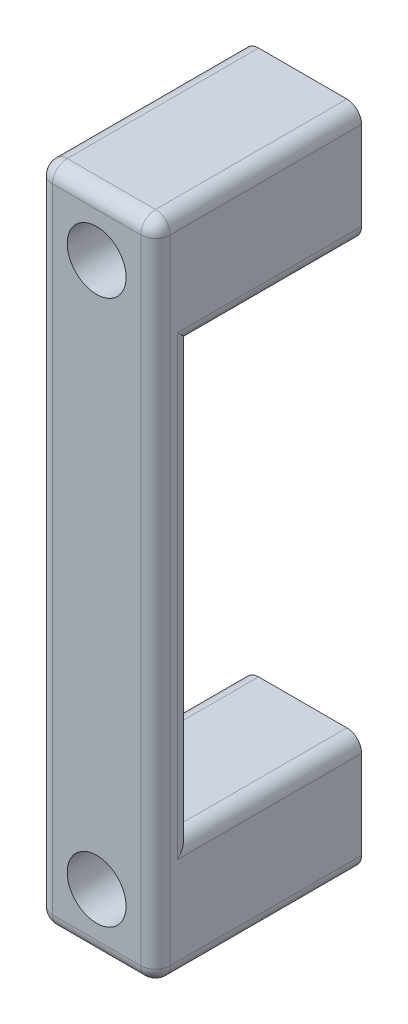
ISO-10303-21;
HEADER;
FILE_DESCRIPTION(('STEP AP214'),'2;1');
FILE_NAME('part.step','',(''),(''),'','','');
FILE_SCHEMA(('AUTOMOTIVE_DESIGN { 1 0 10303 214 1 1 1 1 }'));
ENDSEC;
DATA;
#1=APPLICATION_CONTEXT('core data for automotive mechanical design processes');
#2=APPLICATION_PROTOCOL_DEFINITION('international standard','automotive_design',2000,#1);
#3=PRODUCT_CONTEXT('',#1,'mechanical');
#4=PRODUCT('Part','Part','',(#3));
#5=PRODUCT_RELATED_PRODUCT_CATEGORY('part','',(#4));
#6=PRODUCT_DEFINITION_FORMATION('','',#4);
#7=PRODUCT_DEFINITION_CONTEXT('part definition',#1,'design');
#8=PRODUCT_DEFINITION('design','',#6,#7);
#9=PRODUCT_DEFINITION_SHAPE('','',#8);
#10=(LENGTH_UNIT() NAMED_UNIT(*) SI_UNIT(.MILLI.,.METRE.));
#11=(NAMED_UNIT(*) PLANE_ANGLE_UNIT() SI_UNIT($,.RADIAN.));
#12=(NAMED_UNIT(*) SI_UNIT($,.STERADIAN.) SOLID_ANGLE_UNIT());
#13=UNCERTAINTY_MEASURE_WITH_UNIT(LENGTH_MEASURE(1.E-05),#10,'distance_accuracy_value','');
#14=(GEOMETRIC_REPRESENTATION_CONTEXT(3) GLOBAL_UNCERTAINTY_ASSIGNED_CONTEXT((#13)) GLOBAL_UNIT_ASSIGNED_CONTEXT((#10,
#11,#12)) REPRESENTATION_CONTEXT('',''));
#15=CARTESIAN_POINT('',(0.,0.,0.));
#16=DIRECTION('',(0.,0.,1.));
#17=DIRECTION('',(1.,0.,0.));
#18=AXIS2_PLACEMENT_3D('',#15,#16,#17);
#19=CARTESIAN_POINT('',(0.,0.,0.));
#20=DIRECTION('',(0.,0.,-1.));
#21=DIRECTION('',(-1.,0.,0.));
#22=AXIS2_PLACEMENT_3D('',#19,#20,#21);
#23=PLANE('',#22);
#24=DIRECTION('',(1.,0.,0.));
#25=VECTOR('',#24,1.);
#26=CARTESIAN_POINT('',(-62.393909959226,16.,0.));
#27=LINE('',#26,#25);
#28=CARTESIAN_POINT('',(2.,16.,0.));
#29=VERTEX_POINT('',#28);
#30=CARTESIAN_POINT('',(14.,16.,0.));
#31=VERTEX_POINT('',#30);
#32=EDGE_CURVE('E397',#29,#31,#27,.T.);
#33=ORIENTED_EDGE('',*,*,#32,.T.);
#34=CARTESIAN_POINT('',(14.,14.,0.));
#35=DIRECTION('',(0.,0.,-1.));
#36=DIRECTION('',(-1.,0.,0.));
#37=AXIS2_PLACEMENT_3D('',#34,#35,#36);
#38=CIRCLE('',#37,2.);
#39=CARTESIAN_POINT('',(16.,14.,0.));
#40=VERTEX_POINT('',#39);
#41=EDGE_CURVE('E272',#31,#40,#38,.T.);
#42=ORIENTED_EDGE('',*,*,#41,.T.);
#43=DIRECTION('',(0.,1.,0.));
#44=VECTOR('',#43,1.);
#45=CARTESIAN_POINT('',(16.,0.,0.));
#46=LINE('',#45,#44);
#47=CARTESIAN_POINT('',(16.,2.,0.));
#48=VERTEX_POINT('',#47);
#49=EDGE_CURVE('E198',#48,#40,#46,.T.);
#50=ORIENTED_EDGE('',*,*,#49,.F.);
#51=CARTESIAN_POINT('',(14.,2.,0.));
#52=DIRECTION('',(0.,0.,-1.));
#53=DIRECTION('',(-1.,0.,0.));
#54=AXIS2_PLACEMENT_3D('',#51,#52,#53);
#55=CIRCLE('',#54,2.);
#56=CARTESIAN_POINT('',(14.,0.,0.));
#57=VERTEX_POINT('',#56);
#58=EDGE_CURVE('E269',#48,#57,#55,.T.);
#59=ORIENTED_EDGE('',*,*,#58,.T.);
#60=DIRECTION('',(1.,0.,0.));
#61=VECTOR('',#60,1.);
#62=CARTESIAN_POINT('',(0.,0.,0.));
#63=LINE('',#62,#61);
#64=CARTESIAN_POINT('',(2.,0.,0.));
#65=VERTEX_POINT('',#64);
#66=EDGE_CURVE('E405',#65,#57,#63,.T.);
#67=ORIENTED_EDGE('',*,*,#66,.F.);
#68=CARTESIAN_POINT('',(2.,2.,0.));
#69=DIRECTION('',(0.,0.,-1.));
#70=DIRECTION('',(-1.,0.,0.));
#71=AXIS2_PLACEMENT_3D('',#68,#69,#70);
#72=CIRCLE('',#71,2.);
#73=CARTESIAN_POINT('',(0.,2.,0.));
#74=VERTEX_POINT('',#73);
#75=EDGE_CURVE('E266',#65,#74,#72,.T.);
#76=ORIENTED_EDGE('',*,*,#75,.T.);
#77=DIRECTION('',(0.,-1.,0.));
#78=VECTOR('',#77,1.);
#79=CARTESIAN_POINT('',(0.,0.,0.));
#80=LINE('',#79,#78);
#81=CARTESIAN_POINT('',(0.,14.,0.));
#82=VERTEX_POINT('',#81);
#83=EDGE_CURVE('E401',#82,#74,#80,.T.);
#84=ORIENTED_EDGE('',*,*,#83,.F.);
#85=CARTESIAN_POINT('',(2.,14.,0.));
#86=DIRECTION('',(0.,0.,-1.));
#87=DIRECTION('',(-1.,0.,0.));
#88=AXIS2_PLACEMENT_3D('',#85,#86,#87);
#89=CIRCLE('',#88,2.);
#90=EDGE_CURVE('E263',#82,#29,#89,.T.);
#91=ORIENTED_EDGE('',*,*,#90,.T.);
#92=EDGE_LOOP('',(#33,#42,#50,#59,#67,#76,#84,#91));
#93=FACE_BOUND('',#92,.T.);
#94=CARTESIAN_POINT('',(8.00000000000001,7.99999999999999,0.));
#95=DIRECTION('',(0.,0.,1.));
#96=DIRECTION('',(1.,0.,0.));
#97=AXIS2_PLACEMENT_3D('',#94,#95,#96);
#98=CIRCLE('',#97,2.2);
#99=CARTESIAN_POINT('',(10.2,7.99999999999999,0.));
#100=VERTEX_POINT('',#99);
#101=EDGE_CURVE('E392',#100,#100,#98,.T.);
#102=ORIENTED_EDGE('',*,*,#101,.T.);
#103=EDGE_LOOP('',(#102));
#104=FACE_BOUND('',#103,.T.);
#105=ADVANCED_FACE('F41',(#93,#104),#23,.T.);
#106=CARTESIAN_POINT('',(0.,0.,28.));
#107=DIRECTION('',(0.,0.,-1.));
#108=DIRECTION('',(-1.,0.,0.));
#109=AXIS2_PLACEMENT_3D('',#106,#107,#108);
#110=PLANE('',#109);
#111=DIRECTION('',(1.,0.,0.));
#112=VECTOR('',#111,1.);
#113=CARTESIAN_POINT('',(0.,2.,28.));
#114=LINE('',#113,#112);
#115=CARTESIAN_POINT('',(2.,2.,28.));
#116=VERTEX_POINT('',#115);
#117=CARTESIAN_POINT('',(14.,2.,28.));
#118=VERTEX_POINT('',#117);
#119=EDGE_CURVE('E290',#116,#118,#114,.T.);
#120=ORIENTED_EDGE('',*,*,#119,.T.);
#121=DIRECTION('',(0.,1.,0.));
#122=VECTOR('',#121,1.);
#123=CARTESIAN_POINT('',(14.,0.,28.));
#124=LINE('',#123,#122);
#125=CARTESIAN_POINT('',(14.,88.,28.));
#126=VERTEX_POINT('',#125);
#127=EDGE_CURVE('E293',#118,#126,#124,.T.);
#128=ORIENTED_EDGE('',*,*,#127,.T.);
#129=DIRECTION('',(-1.,0.,0.));
#130=VECTOR('',#129,1.);
#131=CARTESIAN_POINT('',(0.,88.,28.));
#132=LINE('',#131,#130);
#133=CARTESIAN_POINT('',(2.,88.,28.));
#134=VERTEX_POINT('',#133);
#135=EDGE_CURVE('E287',#126,#134,#132,.T.);
#136=ORIENTED_EDGE('',*,*,#135,.T.);
#137=DIRECTION('',(0.,-1.,0.));
#138=VECTOR('',#137,1.);
#139=CARTESIAN_POINT('',(2.,0.,28.));
#140=LINE('',#139,#138);
#141=EDGE_CURVE('E284',#134,#116,#140,.T.);
#142=ORIENTED_EDGE('',*,*,#141,.T.);
#143=EDGE_LOOP('',(#120,#128,#136,#142));
#144=FACE_BOUND('',#143,.T.);
#145=CARTESIAN_POINT('',(8.,82.,28.));
#146=DIRECTION('',(0.,0.,1.));
#147=DIRECTION('',(1.,0.,0.));
#148=AXIS2_PLACEMENT_3D('',#145,#146,#147);
#149=CIRCLE('',#148,4.);
#150=CARTESIAN_POINT('',(12.,82.,28.));
#151=VERTEX_POINT('',#150);
#152=EDGE_CURVE('E487',#151,#151,#149,.T.);
#153=ORIENTED_EDGE('',*,*,#152,.F.);
#154=EDGE_LOOP('',(#153));
#155=FACE_BOUND('',#154,.T.);
#156=CARTESIAN_POINT('',(8.00000000000001,7.99999999999999,28.));
#157=DIRECTION('',(0.,0.,1.));
#158=DIRECTION('',(1.,0.,0.));
#159=AXIS2_PLACEMENT_3D('',#156,#157,#158);
#160=CIRCLE('',#159,4.);
#161=CARTESIAN_POINT('',(12.,7.99999999999999,28.));
#162=VERTEX_POINT('',#161);
#163=EDGE_CURVE('E357',#162,#162,#160,.T.);
#164=ORIENTED_EDGE('',*,*,#163,.F.);
#165=EDGE_LOOP('',(#164));
#166=FACE_BOUND('',#165,.T.);
#167=ADVANCED_FACE('F501',(#144,#155,#166),#110,.F.);
#168=DIRECTION('',(-1.,0.,0.));
#169=VECTOR('',#168,1.);
#170=CARTESIAN_POINT('',(0.,90.,0.));
#171=LINE('',#170,#169);
#172=CARTESIAN_POINT('',(14.,90.,0.));
#173=VERTEX_POINT('',#172);
#174=CARTESIAN_POINT('',(2.,90.,0.));
#175=VERTEX_POINT('',#174);
#176=EDGE_CURVE('E184',#173,#175,#171,.T.);
#177=ORIENTED_EDGE('',*,*,#176,.F.);
#178=CARTESIAN_POINT('',(14.,88.,0.));
#179=DIRECTION('',(0.,0.,-1.));
#180=DIRECTION('',(-1.,0.,0.));
#181=AXIS2_PLACEMENT_3D('',#178,#179,#180);
#182=CIRCLE('',#181,2.);
#183=CARTESIAN_POINT('',(16.,88.,0.));
#184=VERTEX_POINT('',#183);
#185=EDGE_CURVE('E167',#173,#184,#182,.T.);
#186=ORIENTED_EDGE('',*,*,#185,.T.);
#187=CARTESIAN_POINT('',(16.,76.,0.));
#188=VERTEX_POINT('',#187);
#189=EDGE_CURVE('E204',#188,#184,#46,.T.);
#190=ORIENTED_EDGE('',*,*,#189,.F.);
#191=CARTESIAN_POINT('',(14.,76.,0.));
#192=DIRECTION('',(0.,0.,-1.));
#193=DIRECTION('',(-1.,0.,0.));
#194=AXIS2_PLACEMENT_3D('',#191,#192,#193);
#195=CIRCLE('',#194,2.);
#196=CARTESIAN_POINT('',(14.,74.,0.));
#197=VERTEX_POINT('',#196);
#198=EDGE_CURVE('E179',#188,#197,#195,.T.);
#199=ORIENTED_EDGE('',*,*,#198,.T.);
#200=DIRECTION('',(1.,0.,0.));
#201=VECTOR('',#200,1.);
#202=CARTESIAN_POINT('',(-62.393909959226,74.,0.));
#203=LINE('',#202,#201);
#204=CARTESIAN_POINT('',(2.,74.,0.));
#205=VERTEX_POINT('',#204);
#206=EDGE_CURVE('E216',#205,#197,#203,.T.);
#207=ORIENTED_EDGE('',*,*,#206,.F.);
#208=CARTESIAN_POINT('',(2.,76.,0.));
#209=DIRECTION('',(0.,0.,-1.));
#210=DIRECTION('',(-1.,0.,0.));
#211=AXIS2_PLACEMENT_3D('',#208,#209,#210);
#212=CIRCLE('',#211,2.);
#213=CARTESIAN_POINT('',(0.,76.,0.));
#214=VERTEX_POINT('',#213);
#215=EDGE_CURVE('E222',#205,#214,#212,.T.);
#216=ORIENTED_EDGE('',*,*,#215,.T.);
#217=CARTESIAN_POINT('',(0.,88.,0.));
#218=VERTEX_POINT('',#217);
#219=EDGE_CURVE('E404',#218,#214,#80,.T.);
#220=ORIENTED_EDGE('',*,*,#219,.F.);
#221=CARTESIAN_POINT('',(2.,88.,0.));
#222=DIRECTION('',(0.,0.,-1.));
#223=DIRECTION('',(-1.,0.,0.));
#224=AXIS2_PLACEMENT_3D('',#221,#222,#223);
#225=CIRCLE('',#224,2.);
#226=EDGE_CURVE('E190',#218,#175,#225,.T.);
#227=ORIENTED_EDGE('',*,*,#226,.T.);
#228=EDGE_LOOP('',(#177,#186,#190,#199,#207,#216,#220,#227));
#229=FACE_BOUND('',#228,.T.);
#230=CARTESIAN_POINT('',(8.,82.,0.));
#231=DIRECTION('',(0.,0.,1.));
#232=DIRECTION('',(1.,0.,0.));
#233=AXIS2_PLACEMENT_3D('',#230,#231,#232);
#234=CIRCLE('',#233,2.19999999999999);
#235=CARTESIAN_POINT('',(10.2,82.,0.));
#236=VERTEX_POINT('',#235);
#237=EDGE_CURVE('E396',#236,#236,#234,.T.);
#238=ORIENTED_EDGE('',*,*,#237,.T.);
#239=EDGE_LOOP('',(#238));
#240=FACE_BOUND('',#239,.T.);
#241=ADVANCED_FACE('F192',(#229,#240),#23,.T.);
#242=CARTESIAN_POINT('',(0.,0.,28.));
#243=DIRECTION('',(1.,0.,0.));
#244=DIRECTION('',(0.,0.,-1.));
#245=AXIS2_PLACEMENT_3D('',#242,#243,#244);
#246=PLANE('',#245);
#247=DIRECTION('',(0.,1.,0.));
#248=VECTOR('',#247,1.);
#249=CARTESIAN_POINT('',(0.,0.,25.));
#250=LINE('',#249,#248);
#251=CARTESIAN_POINT('',(0.,76.,25.));
#252=VERTEX_POINT('',#251);
#253=CARTESIAN_POINT('',(0.,14.,25.));
#254=VERTEX_POINT('',#253);
#255=EDGE_CURVE('E51',#252,#254,#250,.F.);
#256=ORIENTED_EDGE('',*,*,#255,.T.);
#257=DIRECTION('',(0.,0.,1.));
#258=VECTOR('',#257,1.);
#259=CARTESIAN_POINT('',(0.,14.,28.));
#260=LINE('',#259,#258);
#261=EDGE_CURVE('E12',#254,#82,#260,.F.);
#262=ORIENTED_EDGE('',*,*,#261,.T.);
#263=ORIENTED_EDGE('',*,*,#83,.T.);
#264=DIRECTION('',(0.,0.,-1.));
#265=VECTOR('',#264,1.);
#266=CARTESIAN_POINT('',(0.,2.,28.));
#267=LINE('',#266,#265);
#268=CARTESIAN_POINT('',(0.,2.,26.));
#269=VERTEX_POINT('',#268);
#270=EDGE_CURVE('E303',#74,#269,#267,.F.);
#271=ORIENTED_EDGE('',*,*,#270,.T.);
#272=DIRECTION('',(0.,-1.,0.));
#273=VECTOR('',#272,1.);
#274=CARTESIAN_POINT('',(0.,0.,26.));
#275=LINE('',#274,#273);
#276=CARTESIAN_POINT('',(0.,88.,26.));
#277=VERTEX_POINT('',#276);
#278=EDGE_CURVE('E297',#269,#277,#275,.F.);
#279=ORIENTED_EDGE('',*,*,#278,.T.);
#280=DIRECTION('',(0.,0.,-1.));
#281=VECTOR('',#280,1.);
#282=CARTESIAN_POINT('',(0.,88.,28.));
#283=LINE('',#282,#281);
#284=EDGE_CURVE('E300',#277,#218,#283,.T.);
#285=ORIENTED_EDGE('',*,*,#284,.T.);
#286=ORIENTED_EDGE('',*,*,#219,.T.);
#287=DIRECTION('',(0.,0.,-1.));
#288=VECTOR('',#287,1.);
#289=CARTESIAN_POINT('',(0.,76.,28.));
#290=LINE('',#289,#288);
#291=EDGE_CURVE('E62',#214,#252,#290,.F.);
#292=ORIENTED_EDGE('',*,*,#291,.T.);
#293=EDGE_LOOP('',(#256,#262,#263,#271,#279,#285,#286,#292));
#294=FACE_BOUND('',#293,.T.);
#295=ADVANCED_FACE('F413',(#294),#246,.F.);
#296=CARTESIAN_POINT('',(0.,0.,28.));
#297=DIRECTION('',(0.,1.,0.));
#298=DIRECTION('',(0.,0.,1.));
#299=AXIS2_PLACEMENT_3D('',#296,#297,#298);
#300=PLANE('',#299);
#301=ORIENTED_EDGE('',*,*,#66,.T.);
#302=DIRECTION('',(0.,0.,-1.));
#303=VECTOR('',#302,1.);
#304=CARTESIAN_POINT('',(14.,0.,28.));
#305=LINE('',#304,#303);
#306=CARTESIAN_POINT('',(14.,0.,26.));
#307=VERTEX_POINT('',#306);
#308=EDGE_CURVE('E281',#57,#307,#305,.F.);
#309=ORIENTED_EDGE('',*,*,#308,.T.);
#310=DIRECTION('',(1.,0.,0.));
#311=VECTOR('',#310,1.);
#312=CARTESIAN_POINT('',(0.,0.,26.));
#313=LINE('',#312,#311);
#314=CARTESIAN_POINT('',(2.,0.,26.));
#315=VERTEX_POINT('',#314);
#316=EDGE_CURVE('E278',#307,#315,#313,.F.);
#317=ORIENTED_EDGE('',*,*,#316,.T.);
#318=DIRECTION('',(0.,0.,-1.));
#319=VECTOR('',#318,1.);
#320=CARTESIAN_POINT('',(2.,0.,28.));
#321=LINE('',#320,#319);
#322=EDGE_CURVE('E275',#315,#65,#321,.T.);
#323=ORIENTED_EDGE('',*,*,#322,.T.);
#324=EDGE_LOOP('',(#301,#309,#317,#323));
#325=FACE_BOUND('',#324,.T.);
#326=ADVANCED_FACE('F451',(#325),#300,.F.);
#327=CARTESIAN_POINT('',(16.,0.,28.));
#328=DIRECTION('',(-1.,0.,0.));
#329=DIRECTION('',(0.,0.,1.));
#330=AXIS2_PLACEMENT_3D('',#327,#328,#329);
#331=PLANE('',#330);
#332=DIRECTION('',(0.,-1.,0.));
#333=VECTOR('',#332,1.);
#334=CARTESIAN_POINT('',(16.,0.,25.));
#335=LINE('',#334,#333);
#336=CARTESIAN_POINT('',(16.,14.,25.));
#337=VERTEX_POINT('',#336);
#338=CARTESIAN_POINT('',(16.,76.,25.));
#339=VERTEX_POINT('',#338);
#340=EDGE_CURVE('E237',#337,#339,#335,.F.);
#341=ORIENTED_EDGE('',*,*,#340,.T.);
#342=DIRECTION('',(0.,0.,1.));
#343=VECTOR('',#342,1.);
#344=CARTESIAN_POINT('',(16.,76.,28.));
#345=LINE('',#344,#343);
#346=EDGE_CURVE('E240',#339,#188,#345,.F.);
#347=ORIENTED_EDGE('',*,*,#346,.T.);
#348=ORIENTED_EDGE('',*,*,#189,.T.);
#349=DIRECTION('',(0.,0.,-1.));
#350=VECTOR('',#349,1.);
#351=CARTESIAN_POINT('',(16.,88.,28.));
#352=LINE('',#351,#350);
#353=CARTESIAN_POINT('',(16.,88.,26.));
#354=VERTEX_POINT('',#353);
#355=EDGE_CURVE('E172',#184,#354,#352,.F.);
#356=ORIENTED_EDGE('',*,*,#355,.T.);
#357=DIRECTION('',(0.,1.,0.));
#358=VECTOR('',#357,1.);
#359=CARTESIAN_POINT('',(16.,0.,26.));
#360=LINE('',#359,#358);
#361=CARTESIAN_POINT('',(16.,2.,26.));
#362=VERTEX_POINT('',#361);
#363=EDGE_CURVE('E178',#354,#362,#360,.F.);
#364=ORIENTED_EDGE('',*,*,#363,.T.);
#365=DIRECTION('',(0.,0.,-1.));
#366=VECTOR('',#365,1.);
#367=CARTESIAN_POINT('',(16.,2.,28.));
#368=LINE('',#367,#366);
#369=EDGE_CURVE('E229',#362,#48,#368,.T.);
#370=ORIENTED_EDGE('',*,*,#369,.T.);
#371=ORIENTED_EDGE('',*,*,#49,.T.);
#372=DIRECTION('',(0.,0.,-1.));
#373=VECTOR('',#372,1.);
#374=CARTESIAN_POINT('',(16.,14.,28.));
#375=LINE('',#374,#373);
#376=EDGE_CURVE('E234',#40,#337,#375,.F.);
#377=ORIENTED_EDGE('',*,*,#376,.T.);
#378=EDGE_LOOP('',(#341,#347,#348,#356,#364,#370,#371,#377));
#379=FACE_BOUND('',#378,.T.);
#380=ADVANCED_FACE('F436',(#379),#331,.F.);
#381=CARTESIAN_POINT('',(0.,90.,28.));
#382=DIRECTION('',(0.,-1.,0.));
#383=DIRECTION('',(0.,0.,-1.));
#384=AXIS2_PLACEMENT_3D('',#381,#382,#383);
#385=PLANE('',#384);
#386=DIRECTION('',(-1.,0.,0.));
#387=VECTOR('',#386,1.);
#388=CARTESIAN_POINT('',(0.,90.,26.));
#389=LINE('',#388,#387);
#390=CARTESIAN_POINT('',(2.,90.,26.));
#391=VERTEX_POINT('',#390);
#392=CARTESIAN_POINT('',(14.,90.,26.));
#393=VERTEX_POINT('',#392);
#394=EDGE_CURVE('E187',#391,#393,#389,.F.);
#395=ORIENTED_EDGE('',*,*,#394,.T.);
#396=DIRECTION('',(0.,0.,-1.));
#397=VECTOR('',#396,1.);
#398=CARTESIAN_POINT('',(14.,90.,28.));
#399=LINE('',#398,#397);
#400=EDGE_CURVE('E171',#393,#173,#399,.T.);
#401=ORIENTED_EDGE('',*,*,#400,.T.);
#402=ORIENTED_EDGE('',*,*,#176,.T.);
#403=DIRECTION('',(0.,0.,-1.));
#404=VECTOR('',#403,1.);
#405=CARTESIAN_POINT('',(2.,90.,28.));
#406=LINE('',#405,#404);
#407=EDGE_CURVE('E197',#175,#391,#406,.F.);
#408=ORIENTED_EDGE('',*,*,#407,.T.);
#409=EDGE_LOOP('',(#395,#401,#402,#408));
#410=FACE_BOUND('',#409,.T.);
#411=ADVANCED_FACE('F183',(#410),#385,.F.);
#412=CARTESIAN_POINT('',(8.,82.,28.));
#413=DIRECTION('',(0.,0.,-1.));
#414=DIRECTION('',(-1.,0.,0.));
#415=AXIS2_PLACEMENT_3D('',#412,#413,#414);
#416=CYLINDRICAL_SURFACE('',#415,2.19999999999999);
#417=CARTESIAN_POINT('',(8.,82.,6.));
#418=DIRECTION('',(0.,0.,-1.));
#419=DIRECTION('',(-1.,0.,0.));
#420=AXIS2_PLACEMENT_3D('',#417,#418,#419);
#421=CIRCLE('',#420,2.19999999999999);
#422=CARTESIAN_POINT('',(5.80000000000001,82.,6.));
#423=VERTEX_POINT('',#422);
#424=EDGE_CURVE('E212',#423,#423,#421,.T.);
#425=ORIENTED_EDGE('',*,*,#424,.F.);
#426=EDGE_LOOP('',(#425));
#427=FACE_BOUND('',#426,.T.);
#428=ORIENTED_EDGE('',*,*,#237,.F.);
#429=EDGE_LOOP('',(#428));
#430=FACE_BOUND('',#429,.T.);
#431=ADVANCED_FACE('F676',(#427,#430),#416,.F.);
#432=CARTESIAN_POINT('',(8.00000000000001,7.99999999999999,28.));
#433=DIRECTION('',(0.,0.,-1.));
#434=DIRECTION('',(-1.,0.,0.));
#435=AXIS2_PLACEMENT_3D('',#432,#433,#434);
#436=CYLINDRICAL_SURFACE('',#435,2.2);
#437=CARTESIAN_POINT('',(8.00000000000001,7.99999999999999,6.));
#438=DIRECTION('',(0.,0.,-1.));
#439=DIRECTION('',(-1.,0.,0.));
#440=AXIS2_PLACEMENT_3D('',#437,#438,#439);
#441=CIRCLE('',#440,2.2);
#442=CARTESIAN_POINT('',(5.80000000000001,7.99999999999999,6.));
#443=VERTEX_POINT('',#442);
#444=EDGE_CURVE('E208',#443,#443,#441,.T.);
#445=ORIENTED_EDGE('',*,*,#444,.F.);
#446=EDGE_LOOP('',(#445));
#447=FACE_BOUND('',#446,.T.);
#448=ORIENTED_EDGE('',*,*,#101,.F.);
#449=EDGE_LOOP('',(#448));
#450=FACE_BOUND('',#449,.T.);
#451=ADVANCED_FACE('F671',(#447,#450),#436,.F.);
#452=CARTESIAN_POINT('',(-62.393909959226,16.,23.));
#453=DIRECTION('',(0.,-1.,0.));
#454=DIRECTION('',(0.,0.,-1.));
#455=AXIS2_PLACEMENT_3D('',#452,#453,#454);
#456=PLANE('',#455);
#457=DIRECTION('',(1.,0.,0.));
#458=VECTOR('',#457,1.);
#459=CARTESIAN_POINT('',(-62.393909959226,16.,23.));
#460=LINE('',#459,#458);
#461=CARTESIAN_POINT('',(2.,16.,23.));
#462=VERTEX_POINT('',#461);
#463=CARTESIAN_POINT('',(14.,16.,23.));
#464=VERTEX_POINT('',#463);
#465=EDGE_CURVE('E388',#462,#464,#460,.T.);
#466=ORIENTED_EDGE('',*,*,#465,.T.);
#467=DIRECTION('',(0.,0.,-1.));
#468=VECTOR('',#467,1.);
#469=CARTESIAN_POINT('',(14.,16.,23.));
#470=LINE('',#469,#468);
#471=EDGE_CURVE('E260',#464,#31,#470,.T.);
#472=ORIENTED_EDGE('',*,*,#471,.T.);
#473=ORIENTED_EDGE('',*,*,#32,.F.);
#474=DIRECTION('',(0.,0.,1.));
#475=VECTOR('',#474,1.);
#476=CARTESIAN_POINT('',(2.,16.,23.));
#477=LINE('',#476,#475);
#478=EDGE_CURVE('E256',#29,#462,#477,.T.);
#479=ORIENTED_EDGE('',*,*,#478,.T.);
#480=EDGE_LOOP('',(#466,#472,#473,#479));
#481=FACE_BOUND('',#480,.T.);
#482=ADVANCED_FACE('F474',(#481),#456,.F.);
#483=CARTESIAN_POINT('',(-62.393909959226,74.,23.));
#484=DIRECTION('',(0.,0.,1.));
#485=DIRECTION('',(1.,0.,0.));
#486=AXIS2_PLACEMENT_3D('',#483,#484,#485);
#487=PLANE('',#486);
#488=DIRECTION('',(1.,0.,0.));
#489=VECTOR('',#488,1.);
#490=CARTESIAN_POINT('',(-62.393909959226,74.,23.));
#491=LINE('',#490,#489);
#492=CARTESIAN_POINT('',(2.,74.,23.));
#493=VERTEX_POINT('',#492);
#494=CARTESIAN_POINT('',(14.,74.,23.));
#495=VERTEX_POINT('',#494);
#496=EDGE_CURVE('E383',#493,#495,#491,.T.);
#497=ORIENTED_EDGE('',*,*,#496,.T.);
#498=DIRECTION('',(0.,-1.,0.));
#499=VECTOR('',#498,1.);
#500=CARTESIAN_POINT('',(14.,74.,23.));
#501=LINE('',#500,#499);
#502=EDGE_CURVE('E253',#495,#464,#501,.T.);
#503=ORIENTED_EDGE('',*,*,#502,.T.);
#504=ORIENTED_EDGE('',*,*,#465,.F.);
#505=DIRECTION('',(0.,1.,0.));
#506=VECTOR('',#505,1.);
#507=CARTESIAN_POINT('',(2.,74.,23.));
#508=LINE('',#507,#506);
#509=EDGE_CURVE('E250',#462,#493,#508,.T.);
#510=ORIENTED_EDGE('',*,*,#509,.T.);
#511=EDGE_LOOP('',(#497,#503,#504,#510));
#512=FACE_BOUND('',#511,.T.);
#513=ADVANCED_FACE('F477',(#512),#487,.F.);
#514=CARTESIAN_POINT('',(-62.393909959226,74.,0.));
#515=DIRECTION('',(0.,1.,0.));
#516=DIRECTION('',(0.,0.,1.));
#517=AXIS2_PLACEMENT_3D('',#514,#515,#516);
#518=PLANE('',#517);
#519=ORIENTED_EDGE('',*,*,#206,.T.);
#520=DIRECTION('',(0.,0.,1.));
#521=VECTOR('',#520,1.);
#522=CARTESIAN_POINT('',(14.,74.,0.));
#523=LINE('',#522,#521);
#524=EDGE_CURVE('E246',#197,#495,#523,.T.);
#525=ORIENTED_EDGE('',*,*,#524,.T.);
#526=ORIENTED_EDGE('',*,*,#496,.F.);
#527=DIRECTION('',(0.,0.,-1.));
#528=VECTOR('',#527,1.);
#529=CARTESIAN_POINT('',(2.,74.,0.));
#530=LINE('',#529,#528);
#531=EDGE_CURVE('E243',#493,#205,#530,.T.);
#532=ORIENTED_EDGE('',*,*,#531,.T.);
#533=EDGE_LOOP('',(#519,#525,#526,#532));
#534=FACE_BOUND('',#533,.T.);
#535=ADVANCED_FACE('F380',(#534),#518,.F.);
#536=CARTESIAN_POINT('',(0.,0.,6.));
#537=DIRECTION('',(0.,0.,-1.));
#538=DIRECTION('',(-1.,0.,0.));
#539=AXIS2_PLACEMENT_3D('',#536,#537,#538);
#540=PLANE('',#539);
#541=ORIENTED_EDGE('',*,*,#444,.T.);
#542=EDGE_LOOP('',(#541));
#543=FACE_BOUND('',#542,.T.);
#544=CARTESIAN_POINT('',(8.00000000000001,7.99999999999999,6.));
#545=DIRECTION('',(0.,0.,-1.));
#546=DIRECTION('',(-1.,0.,0.));
#547=AXIS2_PLACEMENT_3D('',#544,#545,#546);
#548=CIRCLE('',#547,4.);
#549=CARTESIAN_POINT('',(4.00000000000001,7.99999999999999,6.));
#550=VERTEX_POINT('',#549);
#551=EDGE_CURVE('E483',#550,#550,#548,.F.);
#552=ORIENTED_EDGE('',*,*,#551,.T.);
#553=EDGE_LOOP('',(#552));
#554=FACE_BOUND('',#553,.T.);
#555=ADVANCED_FACE('F512',(#543,#554),#540,.F.);
#556=CARTESIAN_POINT('',(8.00000000000001,7.99999999999999,-11.3137084989848));
#557=DIRECTION('',(0.,0.,1.));
#558=DIRECTION('',(1.,0.,0.));
#559=AXIS2_PLACEMENT_3D('',#556,#557,#558);
#560=CYLINDRICAL_SURFACE('',#559,4.);
#561=ORIENTED_EDGE('',*,*,#163,.T.);
#562=EDGE_LOOP('',(#561));
#563=FACE_BOUND('',#562,.T.);
#564=ORIENTED_EDGE('',*,*,#551,.F.);
#565=EDGE_LOOP('',(#564));
#566=FACE_BOUND('',#565,.T.);
#567=ADVANCED_FACE('F508',(#563,#566),#560,.F.);
#568=CARTESIAN_POINT('',(0.,0.,6.));
#569=DIRECTION('',(0.,0.,-1.));
#570=DIRECTION('',(-1.,0.,0.));
#571=AXIS2_PLACEMENT_3D('',#568,#569,#570);
#572=PLANE('',#571);
#573=ORIENTED_EDGE('',*,*,#424,.T.);
#574=EDGE_LOOP('',(#573));
#575=FACE_BOUND('',#574,.T.);
#576=CARTESIAN_POINT('',(8.,82.,6.));
#577=DIRECTION('',(0.,0.,-1.));
#578=DIRECTION('',(-1.,0.,0.));
#579=AXIS2_PLACEMENT_3D('',#576,#577,#578);
#580=CIRCLE('',#579,4.);
#581=CARTESIAN_POINT('',(4.,82.,6.));
#582=VERTEX_POINT('',#581);
#583=EDGE_CURVE('E213',#582,#582,#580,.F.);
#584=ORIENTED_EDGE('',*,*,#583,.T.);
#585=EDGE_LOOP('',(#584));
#586=FACE_BOUND('',#585,.T.);
#587=ADVANCED_FACE('F511',(#575,#586),#572,.F.);
#588=CARTESIAN_POINT('',(8.,82.,-11.3137084989848));
#589=DIRECTION('',(0.,0.,1.));
#590=DIRECTION('',(1.,0.,0.));
#591=AXIS2_PLACEMENT_3D('',#588,#589,#590);
#592=CYLINDRICAL_SURFACE('',#591,4.);
#593=ORIENTED_EDGE('',*,*,#152,.T.);
#594=EDGE_LOOP('',(#593));
#595=FACE_BOUND('',#594,.T.);
#596=ORIENTED_EDGE('',*,*,#583,.F.);
#597=EDGE_LOOP('',(#596));
#598=FACE_BOUND('',#597,.T.);
#599=ADVANCED_FACE('F498',(#595,#598),#592,.F.);
#600=CARTESIAN_POINT('',(2.,2.,28.));
#601=DIRECTION('',(0.,0.,-1.));
#602=DIRECTION('',(-1.,0.,0.));
#603=AXIS2_PLACEMENT_3D('',#600,#601,#602);
#604=CYLINDRICAL_SURFACE('',#603,2.);
#605=CARTESIAN_POINT('',(2.,2.,26.));
#606=DIRECTION('',(0.,0.,1.));
#607=DIRECTION('',(1.,0.,0.));
#608=AXIS2_PLACEMENT_3D('',#605,#606,#607);
#609=CIRCLE('',#608,2.);
#610=EDGE_CURVE('E353',#269,#315,#609,.T.);
#611=ORIENTED_EDGE('',*,*,#610,.F.);
#612=ORIENTED_EDGE('',*,*,#270,.F.);
#613=ORIENTED_EDGE('',*,*,#75,.F.);
#614=ORIENTED_EDGE('',*,*,#322,.F.);
#615=EDGE_LOOP('',(#611,#612,#613,#614));
#616=FACE_BOUND('',#615,.T.);
#617=ADVANCED_FACE('F455',(#616),#604,.T.);
#618=CARTESIAN_POINT('',(2.,2.,26.));
#619=DIRECTION('',(0.,0.,1.));
#620=DIRECTION('',(1.,0.,0.));
#621=AXIS2_PLACEMENT_3D('',#618,#619,#620);
#622=SPHERICAL_SURFACE('',#621,2.);
#623=CARTESIAN_POINT('',(2.,2.,26.));
#624=DIRECTION('',(0.,-1.,0.));
#625=DIRECTION('',(0.,0.,-1.));
#626=AXIS2_PLACEMENT_3D('',#623,#624,#625);
#627=CIRCLE('',#626,2.);
#628=EDGE_CURVE('E345',#269,#116,#627,.F.);
#629=ORIENTED_EDGE('',*,*,#628,.F.);
#630=ORIENTED_EDGE('',*,*,#610,.T.);
#631=CARTESIAN_POINT('',(2.,2.,26.));
#632=DIRECTION('',(-1.,0.,0.));
#633=DIRECTION('',(0.,0.,1.));
#634=AXIS2_PLACEMENT_3D('',#631,#632,#633);
#635=CIRCLE('',#634,2.);
#636=EDGE_CURVE('E349',#116,#315,#635,.F.);
#637=ORIENTED_EDGE('',*,*,#636,.F.);
#638=EDGE_LOOP('',(#629,#630,#637));
#639=FACE_BOUND('',#638,.T.);
#640=ADVANCED_FACE('F459',(#639),#622,.T.);
#641=CARTESIAN_POINT('',(14.,2.,28.));
#642=DIRECTION('',(0.,0.,-1.));
#643=DIRECTION('',(-1.,0.,0.));
#644=AXIS2_PLACEMENT_3D('',#641,#642,#643);
#645=CYLINDRICAL_SURFACE('',#644,2.);
#646=ORIENTED_EDGE('',*,*,#58,.F.);
#647=ORIENTED_EDGE('',*,*,#369,.F.);
#648=CARTESIAN_POINT('',(14.,2.,26.));
#649=DIRECTION('',(0.,0.,1.));
#650=DIRECTION('',(1.,0.,0.));
#651=AXIS2_PLACEMENT_3D('',#648,#649,#650);
#652=CIRCLE('',#651,2.);
#653=EDGE_CURVE('E341',#307,#362,#652,.T.);
#654=ORIENTED_EDGE('',*,*,#653,.F.);
#655=ORIENTED_EDGE('',*,*,#308,.F.);
#656=EDGE_LOOP('',(#646,#647,#654,#655));
#657=FACE_BOUND('',#656,.T.);
#658=ADVANCED_FACE('F441',(#657),#645,.T.);
#659=CARTESIAN_POINT('',(0.,2.,26.));
#660=DIRECTION('',(1.,0.,0.));
#661=DIRECTION('',(0.,0.,-1.));
#662=AXIS2_PLACEMENT_3D('',#659,#660,#661);
#663=CYLINDRICAL_SURFACE('',#662,2.);
#664=ORIENTED_EDGE('',*,*,#636,.T.);
#665=ORIENTED_EDGE('',*,*,#316,.F.);
#666=CARTESIAN_POINT('',(14.,2.,26.));
#667=DIRECTION('',(1.,0.,0.));
#668=DIRECTION('',(0.,0.,-1.));
#669=AXIS2_PLACEMENT_3D('',#666,#667,#668);
#670=CIRCLE('',#669,2.);
#671=EDGE_CURVE('E337',#118,#307,#670,.T.);
#672=ORIENTED_EDGE('',*,*,#671,.F.);
#673=ORIENTED_EDGE('',*,*,#119,.F.);
#674=EDGE_LOOP('',(#664,#665,#672,#673));
#675=FACE_BOUND('',#674,.T.);
#676=ADVANCED_FACE('F448',(#675),#663,.T.);
#677=CARTESIAN_POINT('',(2.,0.,26.));
#678=DIRECTION('',(0.,-1.,0.));
#679=DIRECTION('',(0.,0.,-1.));
#680=AXIS2_PLACEMENT_3D('',#677,#678,#679);
#681=CYLINDRICAL_SURFACE('',#680,2.);
#682=ORIENTED_EDGE('',*,*,#628,.T.);
#683=ORIENTED_EDGE('',*,*,#141,.F.);
#684=CARTESIAN_POINT('',(2.,88.,26.));
#685=DIRECTION('',(0.,1.,0.));
#686=DIRECTION('',(0.,0.,1.));
#687=AXIS2_PLACEMENT_3D('',#684,#685,#686);
#688=CIRCLE('',#687,2.);
#689=EDGE_CURVE('E333',#277,#134,#688,.T.);
#690=ORIENTED_EDGE('',*,*,#689,.F.);
#691=ORIENTED_EDGE('',*,*,#278,.F.);
#692=EDGE_LOOP('',(#682,#683,#690,#691));
#693=FACE_BOUND('',#692,.T.);
#694=ADVANCED_FACE('F463',(#693),#681,.T.);
#695=CARTESIAN_POINT('',(2.,88.,28.));
#696=DIRECTION('',(0.,0.,-1.));
#697=DIRECTION('',(-1.,0.,0.));
#698=AXIS2_PLACEMENT_3D('',#695,#696,#697);
#699=CYLINDRICAL_SURFACE('',#698,2.);
#700=ORIENTED_EDGE('',*,*,#226,.F.);
#701=ORIENTED_EDGE('',*,*,#284,.F.);
#702=CARTESIAN_POINT('',(2.,88.,26.));
#703=DIRECTION('',(0.,0.,1.));
#704=DIRECTION('',(1.,0.,0.));
#705=AXIS2_PLACEMENT_3D('',#702,#703,#704);
#706=CIRCLE('',#705,2.);
#707=EDGE_CURVE('E329',#391,#277,#706,.T.);
#708=ORIENTED_EDGE('',*,*,#707,.F.);
#709=ORIENTED_EDGE('',*,*,#407,.F.);
#710=EDGE_LOOP('',(#700,#701,#708,#709));
#711=FACE_BOUND('',#710,.T.);
#712=ADVANCED_FACE('F416',(#711),#699,.T.);
#713=CARTESIAN_POINT('',(14.,2.,26.));
#714=DIRECTION('',(0.,0.,1.));
#715=DIRECTION('',(1.,0.,0.));
#716=AXIS2_PLACEMENT_3D('',#713,#714,#715);
#717=SPHERICAL_SURFACE('',#716,2.);
#718=ORIENTED_EDGE('',*,*,#671,.T.);
#719=ORIENTED_EDGE('',*,*,#653,.T.);
#720=CARTESIAN_POINT('',(14.,2.,26.));
#721=DIRECTION('',(0.,-1.,0.));
#722=DIRECTION('',(0.,0.,-1.));
#723=AXIS2_PLACEMENT_3D('',#720,#721,#722);
#724=CIRCLE('',#723,2.);
#725=EDGE_CURVE('E325',#118,#362,#724,.F.);
#726=ORIENTED_EDGE('',*,*,#725,.F.);
#727=EDGE_LOOP('',(#718,#719,#726));
#728=FACE_BOUND('',#727,.T.);
#729=ADVANCED_FACE('F443',(#728),#717,.T.);
#730=CARTESIAN_POINT('',(2.,88.,26.));
#731=DIRECTION('',(0.,0.,1.));
#732=DIRECTION('',(1.,0.,0.));
#733=AXIS2_PLACEMENT_3D('',#730,#731,#732);
#734=SPHERICAL_SURFACE('',#733,2.);
#735=ORIENTED_EDGE('',*,*,#707,.T.);
#736=ORIENTED_EDGE('',*,*,#689,.T.);
#737=CARTESIAN_POINT('',(2.,88.,26.));
#738=DIRECTION('',(-1.,0.,0.));
#739=DIRECTION('',(0.,0.,1.));
#740=AXIS2_PLACEMENT_3D('',#737,#738,#739);
#741=CIRCLE('',#740,2.);
#742=EDGE_CURVE('E321',#391,#134,#741,.F.);
#743=ORIENTED_EDGE('',*,*,#742,.F.);
#744=EDGE_LOOP('',(#735,#736,#743));
#745=FACE_BOUND('',#744,.T.);
#746=ADVANCED_FACE('F421',(#745),#734,.T.);
#747=CARTESIAN_POINT('',(14.,0.,26.));
#748=DIRECTION('',(0.,1.,0.));
#749=DIRECTION('',(0.,0.,1.));
#750=AXIS2_PLACEMENT_3D('',#747,#748,#749);
#751=CYLINDRICAL_SURFACE('',#750,2.);
#752=ORIENTED_EDGE('',*,*,#725,.T.);
#753=ORIENTED_EDGE('',*,*,#363,.F.);
#754=CARTESIAN_POINT('',(14.,88.,26.));
#755=DIRECTION('',(0.,1.,0.));
#756=DIRECTION('',(0.,0.,1.));
#757=AXIS2_PLACEMENT_3D('',#754,#755,#756);
#758=CIRCLE('',#757,2.);
#759=EDGE_CURVE('E317',#126,#354,#758,.T.);
#760=ORIENTED_EDGE('',*,*,#759,.F.);
#761=ORIENTED_EDGE('',*,*,#127,.F.);
#762=EDGE_LOOP('',(#752,#753,#760,#761));
#763=FACE_BOUND('',#762,.T.);
#764=ADVANCED_FACE('F432',(#763),#751,.T.);
#765=CARTESIAN_POINT('',(0.,88.,26.));
#766=DIRECTION('',(-1.,0.,0.));
#767=DIRECTION('',(0.,0.,1.));
#768=AXIS2_PLACEMENT_3D('',#765,#766,#767);
#769=CYLINDRICAL_SURFACE('',#768,2.);
#770=ORIENTED_EDGE('',*,*,#742,.T.);
#771=ORIENTED_EDGE('',*,*,#135,.F.);
#772=CARTESIAN_POINT('',(14.,88.,26.));
#773=DIRECTION('',(1.,0.,0.));
#774=DIRECTION('',(0.,0.,-1.));
#775=AXIS2_PLACEMENT_3D('',#772,#773,#774);
#776=CIRCLE('',#775,2.);
#777=EDGE_CURVE('E313',#393,#126,#776,.T.);
#778=ORIENTED_EDGE('',*,*,#777,.F.);
#779=ORIENTED_EDGE('',*,*,#394,.F.);
#780=EDGE_LOOP('',(#770,#771,#778,#779));
#781=FACE_BOUND('',#780,.T.);
#782=ADVANCED_FACE('F424',(#781),#769,.T.);
#783=CARTESIAN_POINT('',(14.,88.,26.));
#784=DIRECTION('',(0.,0.,1.));
#785=DIRECTION('',(1.,0.,0.));
#786=AXIS2_PLACEMENT_3D('',#783,#784,#785);
#787=SPHERICAL_SURFACE('',#786,2.);
#788=ORIENTED_EDGE('',*,*,#777,.T.);
#789=ORIENTED_EDGE('',*,*,#759,.T.);
#790=CARTESIAN_POINT('',(14.,88.,26.));
#791=DIRECTION('',(0.,0.,1.));
#792=DIRECTION('',(1.,0.,0.));
#793=AXIS2_PLACEMENT_3D('',#790,#791,#792);
#794=CIRCLE('',#793,2.);
#795=EDGE_CURVE('E310',#393,#354,#794,.F.);
#796=ORIENTED_EDGE('',*,*,#795,.F.);
#797=EDGE_LOOP('',(#788,#789,#796));
#798=FACE_BOUND('',#797,.T.);
#799=ADVANCED_FACE('F428',(#798),#787,.T.);
#800=CARTESIAN_POINT('',(14.,88.,28.));
#801=DIRECTION('',(0.,0.,-1.));
#802=DIRECTION('',(-1.,0.,0.));
#803=AXIS2_PLACEMENT_3D('',#800,#801,#802);
#804=CYLINDRICAL_SURFACE('',#803,2.);
#805=ORIENTED_EDGE('',*,*,#795,.T.);
#806=ORIENTED_EDGE('',*,*,#355,.F.);
#807=ORIENTED_EDGE('',*,*,#185,.F.);
#808=ORIENTED_EDGE('',*,*,#400,.F.);
#809=EDGE_LOOP('',(#805,#806,#807,#808));
#810=FACE_BOUND('',#809,.T.);
#811=ADVANCED_FACE('F170',(#810),#804,.T.);
#812=CARTESIAN_POINT('',(14.,14.,23.));
#813=DIRECTION('',(0.,0.,-1.));
#814=DIRECTION('',(-1.,0.,0.));
#815=AXIS2_PLACEMENT_3D('',#812,#813,#814);
#816=CYLINDRICAL_SURFACE('',#815,2.);
#817=ORIENTED_EDGE('',*,*,#41,.F.);
#818=ORIENTED_EDGE('',*,*,#471,.F.);
#819=CARTESIAN_POINT('',(14.,14.,25.));
#820=DIRECTION('',(0.,-0.707106781186547,-0.707106781186547));
#821=DIRECTION('',(0.,-0.707106781186547,0.707106781186547));
#822=AXIS2_PLACEMENT_3D('',#819,#820,#821);
#823=ELLIPSE('',#822,2.82842712474619,2.);
#824=EDGE_CURVE('E314',#337,#464,#823,.F.);
#825=ORIENTED_EDGE('',*,*,#824,.F.);
#826=ORIENTED_EDGE('',*,*,#376,.F.);
#827=EDGE_LOOP('',(#817,#818,#825,#826));
#828=FACE_BOUND('',#827,.T.);
#829=ADVANCED_FACE('F542',(#828),#816,.T.);
#830=CARTESIAN_POINT('',(14.,74.,25.));
#831=DIRECTION('',(0.,-1.,0.));
#832=DIRECTION('',(0.,0.,-1.));
#833=AXIS2_PLACEMENT_3D('',#830,#831,#832);
#834=CYLINDRICAL_SURFACE('',#833,2.);
#835=ORIENTED_EDGE('',*,*,#824,.T.);
#836=ORIENTED_EDGE('',*,*,#502,.F.);
#837=CARTESIAN_POINT('',(14.,76.,25.));
#838=DIRECTION('',(0.,-0.707106781186547,0.707106781186547));
#839=DIRECTION('',(0.,0.707106781186547,0.707106781186547));
#840=AXIS2_PLACEMENT_3D('',#837,#838,#839);
#841=ELLIPSE('',#840,2.82842712474619,2.);
#842=EDGE_CURVE('E358',#339,#495,#841,.F.);
#843=ORIENTED_EDGE('',*,*,#842,.F.);
#844=ORIENTED_EDGE('',*,*,#340,.F.);
#845=EDGE_LOOP('',(#835,#836,#843,#844));
#846=FACE_BOUND('',#845,.T.);
#847=ADVANCED_FACE('F568',(#846),#834,.T.);
#848=CARTESIAN_POINT('',(14.,76.,0.));
#849=DIRECTION('',(0.,0.,1.));
#850=DIRECTION('',(1.,0.,0.));
#851=AXIS2_PLACEMENT_3D('',#848,#849,#850);
#852=CYLINDRICAL_SURFACE('',#851,2.);
#853=ORIENTED_EDGE('',*,*,#198,.F.);
#854=ORIENTED_EDGE('',*,*,#346,.F.);
#855=ORIENTED_EDGE('',*,*,#842,.T.);
#856=ORIENTED_EDGE('',*,*,#524,.F.);
#857=EDGE_LOOP('',(#853,#854,#855,#856));
#858=FACE_BOUND('',#857,.T.);
#859=ADVANCED_FACE('F565',(#858),#852,.T.);
#860=CARTESIAN_POINT('',(2.,76.,0.));
#861=DIRECTION('',(0.,0.,-1.));
#862=DIRECTION('',(-1.,0.,0.));
#863=AXIS2_PLACEMENT_3D('',#860,#861,#862);
#864=CYLINDRICAL_SURFACE('',#863,2.);
#865=ORIENTED_EDGE('',*,*,#215,.F.);
#866=ORIENTED_EDGE('',*,*,#531,.F.);
#867=CARTESIAN_POINT('',(2.,76.,25.));
#868=DIRECTION('',(0.,0.707106781186547,-0.707106781186547));
#869=DIRECTION('',(0.,0.707106781186547,0.707106781186547));
#870=AXIS2_PLACEMENT_3D('',#867,#868,#869);
#871=ELLIPSE('',#870,2.82842712474619,2.);
#872=EDGE_CURVE('E45',#252,#493,#871,.F.);
#873=ORIENTED_EDGE('',*,*,#872,.F.);
#874=ORIENTED_EDGE('',*,*,#291,.F.);
#875=EDGE_LOOP('',(#865,#866,#873,#874));
#876=FACE_BOUND('',#875,.T.);
#877=ADVANCED_FACE('F43',(#876),#864,.T.);
#878=CARTESIAN_POINT('',(2.,74.,25.));
#879=DIRECTION('',(0.,1.,0.));
#880=DIRECTION('',(0.,0.,1.));
#881=AXIS2_PLACEMENT_3D('',#878,#879,#880);
#882=CYLINDRICAL_SURFACE('',#881,2.);
#883=ORIENTED_EDGE('',*,*,#872,.T.);
#884=ORIENTED_EDGE('',*,*,#509,.F.);
#885=CARTESIAN_POINT('',(2.,14.,25.));
#886=DIRECTION('',(0.,0.707106781186547,0.707106781186547));
#887=DIRECTION('',(0.,-0.707106781186547,0.707106781186547));
#888=AXIS2_PLACEMENT_3D('',#885,#886,#887);
#889=ELLIPSE('',#888,2.82842712474619,2.);
#890=EDGE_CURVE('E363',#254,#462,#889,.F.);
#891=ORIENTED_EDGE('',*,*,#890,.F.);
#892=ORIENTED_EDGE('',*,*,#255,.F.);
#893=EDGE_LOOP('',(#883,#884,#891,#892));
#894=FACE_BOUND('',#893,.T.);
#895=ADVANCED_FACE('F372',(#894),#882,.T.);
#896=CARTESIAN_POINT('',(2.,14.,23.));
#897=DIRECTION('',(0.,0.,1.));
#898=DIRECTION('',(1.,0.,0.));
#899=AXIS2_PLACEMENT_3D('',#896,#897,#898);
#900=CYLINDRICAL_SURFACE('',#899,2.);
#901=ORIENTED_EDGE('',*,*,#90,.F.);
#902=ORIENTED_EDGE('',*,*,#261,.F.);
#903=ORIENTED_EDGE('',*,*,#890,.T.);
#904=ORIENTED_EDGE('',*,*,#478,.F.);
#905=EDGE_LOOP('',(#901,#902,#903,#904));
#906=FACE_BOUND('',#905,.T.);
#907=ADVANCED_FACE('F470',(#906),#900,.T.);
#908=CLOSED_SHELL('',(#105,#167,#241,#295,#326,#380,#411,#431,#451,#482,#513,#535,#555,#567,
#587,#599,#617,#640,#658,#676,#694,#712,#729,#746,#764,#782,#799,#811,#829,#847,#859,#877,#895,#907));
#909=MANIFOLD_SOLID_BREP('B2',#908);
#910=ADVANCED_BREP_SHAPE_REPRESENTATION('',(#18,#909),#14);
#911=SHAPE_DEFINITION_REPRESENTATION(#9,#910);
ENDSEC;
END-ISO-10303-21;
